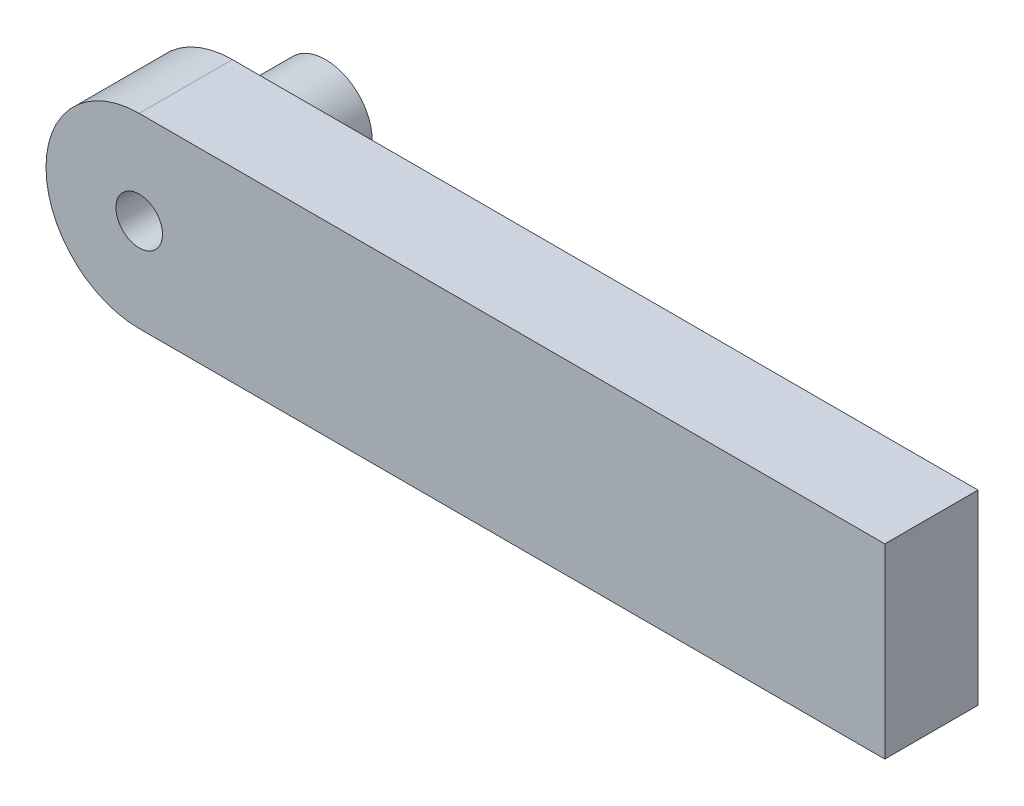
ISO-10303-21;
HEADER;
FILE_DESCRIPTION(('STEP AP214'),'2;1');
FILE_NAME('part.step','',(''),(''),'','','');
FILE_SCHEMA(('AUTOMOTIVE_DESIGN { 1 0 10303 214 1 1 1 1 }'));
ENDSEC;
DATA;
#1=APPLICATION_CONTEXT('core data for automotive mechanical design processes');
#2=APPLICATION_PROTOCOL_DEFINITION('international standard','automotive_design',2000,#1);
#3=PRODUCT_CONTEXT('',#1,'mechanical');
#4=PRODUCT('Part','Part','',(#3));
#5=PRODUCT_RELATED_PRODUCT_CATEGORY('part','',(#4));
#6=PRODUCT_DEFINITION_FORMATION('','',#4);
#7=PRODUCT_DEFINITION_CONTEXT('part definition',#1,'design');
#8=PRODUCT_DEFINITION('design','',#6,#7);
#9=PRODUCT_DEFINITION_SHAPE('','',#8);
#10=(LENGTH_UNIT() NAMED_UNIT(*) SI_UNIT(.MILLI.,.METRE.));
#11=(NAMED_UNIT(*) PLANE_ANGLE_UNIT() SI_UNIT($,.RADIAN.));
#12=(NAMED_UNIT(*) SI_UNIT($,.STERADIAN.) SOLID_ANGLE_UNIT());
#13=UNCERTAINTY_MEASURE_WITH_UNIT(LENGTH_MEASURE(1.E-05),#10,'distance_accuracy_value','');
#14=(GEOMETRIC_REPRESENTATION_CONTEXT(3) GLOBAL_UNCERTAINTY_ASSIGNED_CONTEXT((#13)) GLOBAL_UNIT_ASSIGNED_CONTEXT((#10,
#11,#12)) REPRESENTATION_CONTEXT('',''));
#15=CARTESIAN_POINT('',(0.,0.,0.));
#16=DIRECTION('',(0.,0.,1.));
#17=DIRECTION('',(1.,0.,0.));
#18=AXIS2_PLACEMENT_3D('',#15,#16,#17);
#19=CARTESIAN_POINT('',(20.,4.50354609929078,5.));
#20=DIRECTION('',(-1.,0.,0.));
#21=DIRECTION('',(0.,0.,1.));
#22=AXIS2_PLACEMENT_3D('',#19,#20,#21);
#23=PLANE('',#22);
#24=DIRECTION('',(0.,1.,0.));
#25=VECTOR('',#24,1.);
#26=CARTESIAN_POINT('',(20.,4.50354609929078,0.));
#27=LINE('',#26,#25);
#28=CARTESIAN_POINT('',(20.,-5.49645390070922,0.));
#29=VERTEX_POINT('',#28);
#30=CARTESIAN_POINT('',(20.,4.50354609929078,0.));
#31=VERTEX_POINT('',#30);
#32=EDGE_CURVE('E102',#29,#31,#27,.T.);
#33=ORIENTED_EDGE('',*,*,#32,.T.);
#34=DIRECTION('',(0.,0.,-1.));
#35=VECTOR('',#34,1.);
#36=CARTESIAN_POINT('',(20.,4.50354609929078,5.));
#37=LINE('',#36,#35);
#38=CARTESIAN_POINT('',(20.,4.50354609929078,5.));
#39=VERTEX_POINT('',#38);
#40=EDGE_CURVE('E44',#39,#31,#37,.T.);
#41=ORIENTED_EDGE('',*,*,#40,.F.);
#42=DIRECTION('',(0.,1.,0.));
#43=VECTOR('',#42,1.);
#44=CARTESIAN_POINT('',(20.,4.50354609929078,5.));
#45=LINE('',#44,#43);
#46=CARTESIAN_POINT('',(20.,-5.49645390070922,5.));
#47=VERTEX_POINT('',#46);
#48=EDGE_CURVE('E88',#47,#39,#45,.T.);
#49=ORIENTED_EDGE('',*,*,#48,.F.);
#50=DIRECTION('',(0.,0.,-1.));
#51=VECTOR('',#50,1.);
#52=CARTESIAN_POINT('',(20.,-5.49645390070922,5.));
#53=LINE('',#52,#51);
#54=EDGE_CURVE('E98',#47,#29,#53,.T.);
#55=ORIENTED_EDGE('',*,*,#54,.T.);
#56=EDGE_LOOP('',(#33,#41,#49,#55));
#57=FACE_BOUND('',#56,.T.);
#58=ADVANCED_FACE('F36',(#57),#23,.F.);
#59=CARTESIAN_POINT('',(20.,4.50354609929078,5.));
#60=DIRECTION('',(0.,-1.,0.));
#61=DIRECTION('',(1.,0.,0.));
#62=AXIS2_PLACEMENT_3D('',#59,#60,#61);
#63=PLANE('',#62);
#64=DIRECTION('',(-1.,0.,0.));
#65=VECTOR('',#64,1.);
#66=CARTESIAN_POINT('',(20.,4.50354609929078,0.));
#67=LINE('',#66,#65);
#68=CARTESIAN_POINT('',(-20.,4.50354609929078,0.));
#69=VERTEX_POINT('',#68);
#70=EDGE_CURVE('E93',#31,#69,#67,.T.);
#71=ORIENTED_EDGE('',*,*,#70,.T.);
#72=DIRECTION('',(0.,0.,-1.));
#73=VECTOR('',#72,1.);
#74=CARTESIAN_POINT('',(-20.,4.50354609929078,5.));
#75=LINE('',#74,#73);
#76=CARTESIAN_POINT('',(-20.,4.50354609929078,5.));
#77=VERTEX_POINT('',#76);
#78=EDGE_CURVE('E91',#77,#69,#75,.T.);
#79=ORIENTED_EDGE('',*,*,#78,.F.);
#80=DIRECTION('',(-1.,0.,0.));
#81=VECTOR('',#80,1.);
#82=CARTESIAN_POINT('',(20.,4.50354609929078,5.));
#83=LINE('',#82,#81);
#84=EDGE_CURVE('E83',#39,#77,#83,.T.);
#85=ORIENTED_EDGE('',*,*,#84,.F.);
#86=ORIENTED_EDGE('',*,*,#40,.T.);
#87=EDGE_LOOP('',(#71,#79,#85,#86));
#88=FACE_BOUND('',#87,.T.);
#89=ADVANCED_FACE('F92',(#88),#63,.F.);
#90=CARTESIAN_POINT('',(-20.,-0.496453900709222,5.));
#91=DIRECTION('',(0.,0.,-1.));
#92=DIRECTION('',(-1.,0.,0.));
#93=AXIS2_PLACEMENT_3D('',#90,#91,#92);
#94=CYLINDRICAL_SURFACE('',#93,5.);
#95=CARTESIAN_POINT('',(-20.,-0.496453900709222,0.));
#96=DIRECTION('',(0.,0.,1.));
#97=DIRECTION('',(1.,0.,0.));
#98=AXIS2_PLACEMENT_3D('',#95,#96,#97);
#99=CIRCLE('',#98,5.);
#100=CARTESIAN_POINT('',(-20.,-5.49645390070922,0.));
#101=VERTEX_POINT('',#100);
#102=EDGE_CURVE('E69',#69,#101,#99,.T.);
#103=ORIENTED_EDGE('',*,*,#102,.T.);
#104=DIRECTION('',(0.,0.,-1.));
#105=VECTOR('',#104,1.);
#106=CARTESIAN_POINT('',(-20.,-5.49645390070922,5.));
#107=LINE('',#106,#105);
#108=CARTESIAN_POINT('',(-20.,-5.49645390070922,5.));
#109=VERTEX_POINT('',#108);
#110=EDGE_CURVE('E94',#109,#101,#107,.T.);
#111=ORIENTED_EDGE('',*,*,#110,.F.);
#112=CARTESIAN_POINT('',(-20.,-0.496453900709222,5.));
#113=DIRECTION('',(0.,0.,1.));
#114=DIRECTION('',(1.,0.,0.));
#115=AXIS2_PLACEMENT_3D('',#112,#113,#114);
#116=CIRCLE('',#115,5.);
#117=EDGE_CURVE('E86',#77,#109,#116,.T.);
#118=ORIENTED_EDGE('',*,*,#117,.F.);
#119=ORIENTED_EDGE('',*,*,#78,.T.);
#120=EDGE_LOOP('',(#103,#111,#118,#119));
#121=FACE_BOUND('',#120,.T.);
#122=ADVANCED_FACE('F96',(#121),#94,.T.);
#123=CARTESIAN_POINT('',(-20.,-5.49645390070922,5.));
#124=DIRECTION('',(0.,1.,0.));
#125=DIRECTION('',(0.,0.,1.));
#126=AXIS2_PLACEMENT_3D('',#123,#124,#125);
#127=PLANE('',#126);
#128=DIRECTION('',(1.,0.,0.));
#129=VECTOR('',#128,1.);
#130=CARTESIAN_POINT('',(-20.,-5.49645390070922,0.));
#131=LINE('',#130,#129);
#132=EDGE_CURVE('E75',#101,#29,#131,.T.);
#133=ORIENTED_EDGE('',*,*,#132,.T.);
#134=ORIENTED_EDGE('',*,*,#54,.F.);
#135=DIRECTION('',(1.,0.,0.));
#136=VECTOR('',#135,1.);
#137=CARTESIAN_POINT('',(-20.,-5.49645390070922,5.));
#138=LINE('',#137,#136);
#139=EDGE_CURVE('E52',#109,#47,#138,.T.);
#140=ORIENTED_EDGE('',*,*,#139,.F.);
#141=ORIENTED_EDGE('',*,*,#110,.T.);
#142=EDGE_LOOP('',(#133,#134,#140,#141));
#143=FACE_BOUND('',#142,.T.);
#144=ADVANCED_FACE('F125',(#143),#127,.F.);
#145=CARTESIAN_POINT('',(-20.,-0.496453900709222,5.));
#146=DIRECTION('',(0.,0.,1.));
#147=DIRECTION('',(1.,0.,0.));
#148=AXIS2_PLACEMENT_3D('',#145,#146,#147);
#149=PLANE('',#148);
#150=CARTESIAN_POINT('',(-20.,-0.496453900709222,5.));
#151=DIRECTION('',(0.,0.,-1.));
#152=DIRECTION('',(-1.,0.,0.));
#153=AXIS2_PLACEMENT_3D('',#150,#151,#152);
#154=CIRCLE('',#153,1.25);
#155=CARTESIAN_POINT('',(-21.25,-0.496453900709222,5.));
#156=VERTEX_POINT('',#155);
#157=EDGE_CURVE('E177',#156,#156,#154,.T.);
#158=ORIENTED_EDGE('',*,*,#157,.T.);
#159=EDGE_LOOP('',(#158));
#160=FACE_BOUND('',#159,.T.);
#161=ORIENTED_EDGE('',*,*,#48,.T.);
#162=ORIENTED_EDGE('',*,*,#84,.T.);
#163=ORIENTED_EDGE('',*,*,#117,.T.);
#164=ORIENTED_EDGE('',*,*,#139,.T.);
#165=EDGE_LOOP('',(#161,#162,#163,#164));
#166=FACE_BOUND('',#165,.T.);
#167=ADVANCED_FACE('F84',(#160,#166),#149,.T.);
#168=CARTESIAN_POINT('',(-20.,-0.496453900709222,0.));
#169=DIRECTION('',(0.,0.,1.));
#170=DIRECTION('',(1.,0.,0.));
#171=AXIS2_PLACEMENT_3D('',#168,#169,#170);
#172=PLANE('',#171);
#173=CARTESIAN_POINT('',(-20.,-0.496453900709222,0.));
#174=DIRECTION('',(0.,0.,1.));
#175=DIRECTION('',(1.,0.,0.));
#176=AXIS2_PLACEMENT_3D('',#173,#174,#175);
#177=CIRCLE('',#176,2.5);
#178=CARTESIAN_POINT('',(-17.5,-0.496453900709222,0.));
#179=VERTEX_POINT('',#178);
#180=EDGE_CURVE('E11',#179,#179,#177,.F.);
#181=ORIENTED_EDGE('',*,*,#180,.F.);
#182=EDGE_LOOP('',(#181));
#183=FACE_BOUND('',#182,.T.);
#184=ORIENTED_EDGE('',*,*,#32,.F.);
#185=ORIENTED_EDGE('',*,*,#132,.F.);
#186=ORIENTED_EDGE('',*,*,#102,.F.);
#187=ORIENTED_EDGE('',*,*,#70,.F.);
#188=EDGE_LOOP('',(#184,#185,#186,#187));
#189=FACE_BOUND('',#188,.T.);
#190=ADVANCED_FACE('F113',(#183,#189),#172,.F.);
#191=CARTESIAN_POINT('',(-20.,-0.496453900709222,-5.));
#192=DIRECTION('',(0.,0.,1.));
#193=DIRECTION('',(1.,0.,0.));
#194=AXIS2_PLACEMENT_3D('',#191,#192,#193);
#195=CYLINDRICAL_SURFACE('',#194,2.5);
#196=CARTESIAN_POINT('',(-20.,-0.496453900709222,-5.));
#197=DIRECTION('',(0.,0.,-1.));
#198=DIRECTION('',(-1.,0.,0.));
#199=AXIS2_PLACEMENT_3D('',#196,#197,#198);
#200=CIRCLE('',#199,2.5);
#201=CARTESIAN_POINT('',(-22.5,-0.496453900709222,-5.));
#202=VERTEX_POINT('',#201);
#203=EDGE_CURVE('E105',#202,#202,#200,.T.);
#204=ORIENTED_EDGE('',*,*,#203,.F.);
#205=EDGE_LOOP('',(#204));
#206=FACE_BOUND('',#205,.T.);
#207=ORIENTED_EDGE('',*,*,#180,.T.);
#208=EDGE_LOOP('',(#207));
#209=FACE_BOUND('',#208,.T.);
#210=ADVANCED_FACE('F115',(#206,#209),#195,.T.);
#211=CARTESIAN_POINT('',(-20.,-0.496453900709222,-5.));
#212=DIRECTION('',(0.,0.,-1.));
#213=DIRECTION('',(-1.,0.,0.));
#214=AXIS2_PLACEMENT_3D('',#211,#212,#213);
#215=PLANE('',#214);
#216=CARTESIAN_POINT('',(-20.,-0.496453900709222,-5.));
#217=DIRECTION('',(0.,0.,-1.));
#218=DIRECTION('',(-1.,0.,0.));
#219=AXIS2_PLACEMENT_3D('',#216,#217,#218);
#220=CIRCLE('',#219,1.25);
#221=CARTESIAN_POINT('',(-21.25,-0.496453900709222,-5.));
#222=VERTEX_POINT('',#221);
#223=EDGE_CURVE('E180',#222,#222,#220,.T.);
#224=ORIENTED_EDGE('',*,*,#223,.F.);
#225=EDGE_LOOP('',(#224));
#226=FACE_BOUND('',#225,.T.);
#227=ORIENTED_EDGE('',*,*,#203,.T.);
#228=EDGE_LOOP('',(#227));
#229=FACE_BOUND('',#228,.T.);
#230=ADVANCED_FACE('F122',(#226,#229),#215,.T.);
#231=CARTESIAN_POINT('',(-20.,-0.496453900709222,5.));
#232=DIRECTION('',(0.,0.,-1.));
#233=DIRECTION('',(-1.,0.,0.));
#234=AXIS2_PLACEMENT_3D('',#231,#232,#233);
#235=CYLINDRICAL_SURFACE('',#234,1.25);
#236=ORIENTED_EDGE('',*,*,#157,.F.);
#237=EDGE_LOOP('',(#236));
#238=FACE_BOUND('',#237,.T.);
#239=ORIENTED_EDGE('',*,*,#223,.T.);
#240=EDGE_LOOP('',(#239));
#241=FACE_BOUND('',#240,.T.);
#242=ADVANCED_FACE('F160',(#238,#241),#235,.F.);
#243=CLOSED_SHELL('',(#58,#89,#122,#144,#167,#190,#210,#230,#242));
#244=MANIFOLD_SOLID_BREP('B2',#243);
#245=ADVANCED_BREP_SHAPE_REPRESENTATION('',(#18,#244),#14);
#246=SHAPE_DEFINITION_REPRESENTATION(#9,#245);
ENDSEC;
END-ISO-10303-21;
